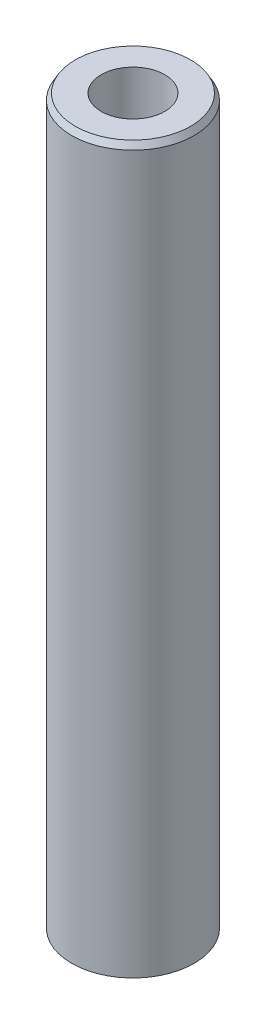
ISO-10303-21;
HEADER;
FILE_DESCRIPTION(('STEP AP214'),'2;1');
FILE_NAME('part.step','',(''),(''),'','','');
FILE_SCHEMA(('AUTOMOTIVE_DESIGN { 1 0 10303 214 1 1 1 1 }'));
ENDSEC;
DATA;
#1=APPLICATION_CONTEXT('core data for automotive mechanical design processes');
#2=APPLICATION_PROTOCOL_DEFINITION('international standard','automotive_design',2000,#1);
#3=PRODUCT_CONTEXT('',#1,'mechanical');
#4=PRODUCT('Part','Part','',(#3));
#5=PRODUCT_RELATED_PRODUCT_CATEGORY('part','',(#4));
#6=PRODUCT_DEFINITION_FORMATION('','',#4);
#7=PRODUCT_DEFINITION_CONTEXT('part definition',#1,'design');
#8=PRODUCT_DEFINITION('design','',#6,#7);
#9=PRODUCT_DEFINITION_SHAPE('','',#8);
#10=(LENGTH_UNIT() NAMED_UNIT(*) SI_UNIT(.MILLI.,.METRE.));
#11=(NAMED_UNIT(*) PLANE_ANGLE_UNIT() SI_UNIT($,.RADIAN.));
#12=(NAMED_UNIT(*) SI_UNIT($,.STERADIAN.) SOLID_ANGLE_UNIT());
#13=UNCERTAINTY_MEASURE_WITH_UNIT(LENGTH_MEASURE(1.E-05),#10,'distance_accuracy_value','');
#14=(GEOMETRIC_REPRESENTATION_CONTEXT(3) GLOBAL_UNCERTAINTY_ASSIGNED_CONTEXT((#13)) GLOBAL_UNIT_ASSIGNED_CONTEXT((#10,
#11,#12)) REPRESENTATION_CONTEXT('',''));
#15=CARTESIAN_POINT('',(0.,0.,0.));
#16=DIRECTION('',(0.,0.,1.));
#17=DIRECTION('',(1.,0.,0.));
#18=AXIS2_PLACEMENT_3D('',#15,#16,#17);
#19=CARTESIAN_POINT('',(0.,504.373598416363,0.));
#20=DIRECTION('',(0.,-1.,0.));
#21=DIRECTION('',(0.,0.,-1.));
#22=AXIS2_PLACEMENT_3D('',#19,#20,#21);
#23=CYLINDRICAL_SURFACE('',#22,42.5);
#24=CARTESIAN_POINT('',(0.,500.054772653858,0.));
#25=DIRECTION('',(0.,1.,0.));
#26=DIRECTION('',(0.,0.,1.));
#27=AXIS2_PLACEMENT_3D('',#24,#25,#26);
#28=CIRCLE('',#27,42.5);
#29=CARTESIAN_POINT('',(0.,500.054772653858,42.5));
#30=VERTEX_POINT('',#29);
#31=EDGE_CURVE('E50',#30,#30,#28,.F.);
#32=ORIENTED_EDGE('',*,*,#31,.T.);
#33=EDGE_LOOP('',(#32));
#34=FACE_BOUND('',#33,.T.);
#35=CARTESIAN_POINT('',(0.,2.49347521656562,0.));
#36=DIRECTION('',(0.,1.,0.));
#37=DIRECTION('',(0.,0.,1.));
#38=AXIS2_PLACEMENT_3D('',#35,#36,#37);
#39=CIRCLE('',#38,42.5);
#40=CARTESIAN_POINT('',(0.,2.49347521656562,42.5));
#41=VERTEX_POINT('',#40);
#42=EDGE_CURVE('E51',#41,#41,#39,.T.);
#43=ORIENTED_EDGE('',*,*,#42,.T.);
#44=EDGE_LOOP('',(#43));
#45=FACE_BOUND('',#44,.T.);
#46=ADVANCED_FACE('F39',(#34,#45),#23,.T.);
#47=CARTESIAN_POINT('',(0.,504.373598416363,0.));
#48=DIRECTION('',(0.,1.,0.));
#49=DIRECTION('',(0.,0.,1.));
#50=AXIS2_PLACEMENT_3D('',#47,#48,#49);
#51=PLANE('',#50);
#52=CARTESIAN_POINT('',(0.,504.373598416363,0.));
#53=DIRECTION('',(0.,1.,0.));
#54=DIRECTION('',(0.,0.,1.));
#55=AXIS2_PLACEMENT_3D('',#52,#53,#54);
#56=CIRCLE('',#55,40.0065247834342);
#57=CARTESIAN_POINT('',(0.,504.373598416363,40.0065247834342));
#58=VERTEX_POINT('',#57);
#59=EDGE_CURVE('E54',#58,#58,#56,.T.);
#60=ORIENTED_EDGE('',*,*,#59,.T.);
#61=EDGE_LOOP('',(#60));
#62=FACE_BOUND('',#61,.T.);
#63=CARTESIAN_POINT('',(0.,504.373598416363,0.));
#64=DIRECTION('',(0.,1.,0.));
#65=DIRECTION('',(0.,0.,1.));
#66=AXIS2_PLACEMENT_3D('',#63,#64,#65);
#67=CIRCLE('',#66,22.0919646653394);
#68=CARTESIAN_POINT('',(0.,504.373598416363,22.0919646653394));
#69=VERTEX_POINT('',#68);
#70=EDGE_CURVE('E58',#69,#69,#67,.T.);
#71=ORIENTED_EDGE('',*,*,#70,.F.);
#72=EDGE_LOOP('',(#71));
#73=FACE_BOUND('',#72,.T.);
#74=ADVANCED_FACE('F69',(#62,#73),#51,.T.);
#75=CARTESIAN_POINT('',(0.,0.,0.));
#76=DIRECTION('',(0.,1.,0.));
#77=DIRECTION('',(0.,0.,1.));
#78=AXIS2_PLACEMENT_3D('',#75,#76,#77);
#79=PLANE('',#78);
#80=CARTESIAN_POINT('',(0.,0.,0.));
#81=DIRECTION('',(0.,1.,0.));
#82=DIRECTION('',(0.,0.,1.));
#83=AXIS2_PLACEMENT_3D('',#80,#81,#82);
#84=CIRCLE('',#83,38.1811742374945);
#85=CARTESIAN_POINT('',(0.,0.,38.1811742374945));
#86=VERTEX_POINT('',#85);
#87=EDGE_CURVE('E10',#86,#86,#84,.F.);
#88=ORIENTED_EDGE('',*,*,#87,.T.);
#89=EDGE_LOOP('',(#88));
#90=FACE_BOUND('',#89,.T.);
#91=CARTESIAN_POINT('',(0.,0.,0.));
#92=DIRECTION('',(0.,1.,0.));
#93=DIRECTION('',(0.,0.,1.));
#94=AXIS2_PLACEMENT_3D('',#91,#92,#93);
#95=CIRCLE('',#94,22.0919646653394);
#96=CARTESIAN_POINT('',(0.,0.,22.0919646653394));
#97=VERTEX_POINT('',#96);
#98=EDGE_CURVE('E63',#97,#97,#95,.T.);
#99=ORIENTED_EDGE('',*,*,#98,.T.);
#100=EDGE_LOOP('',(#99));
#101=FACE_BOUND('',#100,.T.);
#102=ADVANCED_FACE('F75',(#90,#101),#79,.F.);
#103=CARTESIAN_POINT('',(0.,504.373598416363,0.));
#104=DIRECTION('',(0.,-1.,0.));
#105=DIRECTION('',(0.,0.,-1.));
#106=AXIS2_PLACEMENT_3D('',#103,#104,#105);
#107=CYLINDRICAL_SURFACE('',#106,22.0919646653394);
#108=ORIENTED_EDGE('',*,*,#70,.T.);
#109=EDGE_LOOP('',(#108));
#110=FACE_BOUND('',#109,.T.);
#111=ORIENTED_EDGE('',*,*,#98,.F.);
#112=EDGE_LOOP('',(#111));
#113=FACE_BOUND('',#112,.T.);
#114=ADVANCED_FACE('F70',(#110,#113),#107,.F.);
#115=CARTESIAN_POINT('',(0.,504.373598416363,0.));
#116=DIRECTION('',(0.,-1.,0.));
#117=DIRECTION('',(0.,0.,-1.));
#118=AXIS2_PLACEMENT_3D('',#115,#116,#117);
#119=CONICAL_SURFACE('',#118,40.0065247834342,0.523598775598293);
#120=ORIENTED_EDGE('',*,*,#31,.F.);
#121=EDGE_LOOP('',(#120));
#122=FACE_BOUND('',#121,.T.);
#123=ORIENTED_EDGE('',*,*,#59,.F.);
#124=EDGE_LOOP('',(#123));
#125=FACE_BOUND('',#124,.T.);
#126=ADVANCED_FACE('F81',(#122,#125),#119,.T.);
#127=CARTESIAN_POINT('',(0.,2.49347521656562,0.));
#128=DIRECTION('',(0.,1.,0.));
#129=DIRECTION('',(0.,0.,1.));
#130=AXIS2_PLACEMENT_3D('',#127,#128,#129);
#131=CONICAL_SURFACE('',#130,42.5,1.04719755119661);
#132=ORIENTED_EDGE('',*,*,#87,.F.);
#133=EDGE_LOOP('',(#132));
#134=FACE_BOUND('',#133,.T.);
#135=ORIENTED_EDGE('',*,*,#42,.F.);
#136=EDGE_LOOP('',(#135));
#137=FACE_BOUND('',#136,.T.);
#138=ADVANCED_FACE('F45',(#134,#137),#131,.T.);
#139=CLOSED_SHELL('',(#46,#74,#102,#114,#126,#138));
#140=MANIFOLD_SOLID_BREP('B2',#139);
#141=ADVANCED_BREP_SHAPE_REPRESENTATION('',(#18,#140),#14);
#142=SHAPE_DEFINITION_REPRESENTATION(#9,#141);
ENDSEC;
END-ISO-10303-21;
